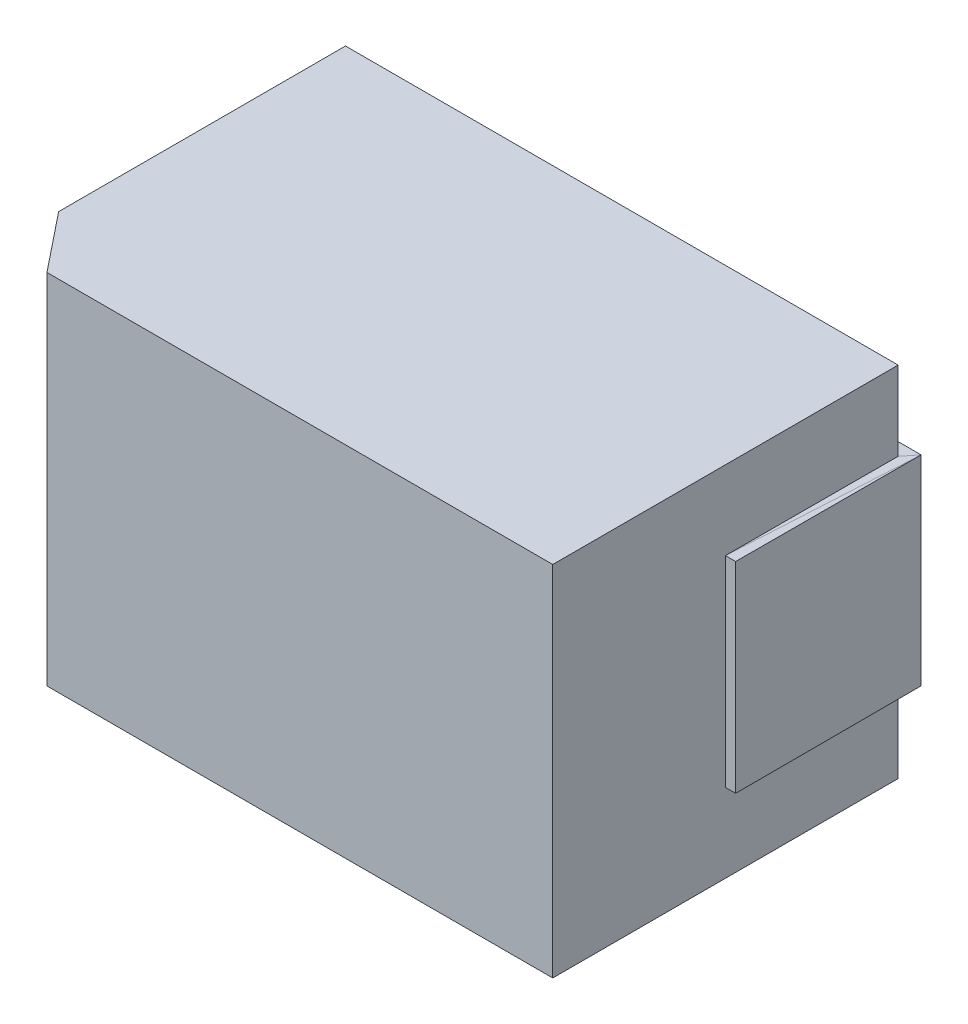
ISO-10303-21;
HEADER;
FILE_DESCRIPTION(('STEP AP214'),'2;1');
FILE_NAME('part.step','',(''),(''),'','','');
FILE_SCHEMA(('AUTOMOTIVE_DESIGN { 1 0 10303 214 1 1 1 1 }'));
ENDSEC;
DATA;
#1=APPLICATION_CONTEXT('core data for automotive mechanical design processes');
#2=APPLICATION_PROTOCOL_DEFINITION('international standard','automotive_design',2000,#1);
#3=PRODUCT_CONTEXT('',#1,'mechanical');
#4=PRODUCT('Part','Part','',(#3));
#5=PRODUCT_RELATED_PRODUCT_CATEGORY('part','',(#4));
#6=PRODUCT_DEFINITION_FORMATION('','',#4);
#7=PRODUCT_DEFINITION_CONTEXT('part definition',#1,'design');
#8=PRODUCT_DEFINITION('design','',#6,#7);
#9=PRODUCT_DEFINITION_SHAPE('','',#8);
#10=(LENGTH_UNIT() NAMED_UNIT(*) SI_UNIT(.MILLI.,.METRE.));
#11=(NAMED_UNIT(*) PLANE_ANGLE_UNIT() SI_UNIT($,.RADIAN.));
#12=(NAMED_UNIT(*) SI_UNIT($,.STERADIAN.) SOLID_ANGLE_UNIT());
#13=UNCERTAINTY_MEASURE_WITH_UNIT(LENGTH_MEASURE(1.E-05),#10,'distance_accuracy_value','');
#14=(GEOMETRIC_REPRESENTATION_CONTEXT(3) GLOBAL_UNCERTAINTY_ASSIGNED_CONTEXT((#13)) GLOBAL_UNIT_ASSIGNED_CONTEXT((#10,
#11,#12)) REPRESENTATION_CONTEXT('',''));
#15=CARTESIAN_POINT('',(0.,0.,0.));
#16=DIRECTION('',(0.,0.,1.));
#17=DIRECTION('',(1.,0.,0.));
#18=AXIS2_PLACEMENT_3D('',#15,#16,#17);
#19=CARTESIAN_POINT('',(-0.983756462733,-0.357373833656,0.664033412933));
#20=DIRECTION('',(0.,0.999998280454692,0.00185447773204043));
#21=DIRECTION('',(0.,-0.00185447773204043,0.999998280454692));
#22=AXIS2_PLACEMENT_3D('',#19,#20,#21);
#23=PLANE('',#22);
#24=DIRECTION('',(0.,0.00185447773165361,-0.999998280454693));
#25=VECTOR('',#24,1.);
#26=CARTESIAN_POINT('',(-1.019999980927,-0.357373833656,0.664033412933));
#27=LINE('',#26,#25);
#28=CARTESIAN_POINT('',(-1.019999980927,-0.357373833656,0.664033412933));
#29=VERTEX_POINT('',#28);
#30=CARTESIAN_POINT('',(-1.01999998092701,-0.356149593989057,0.00388120890905479));
#31=VERTEX_POINT('',#30);
#32=EDGE_CURVE('E144',#29,#31,#27,.T.);
#33=ORIENTED_EDGE('',*,*,#32,.T.);
#34=DIRECTION('',(-0.0548191105613321,0.00185168915759151,-0.998494585045171));
#35=VECTOR('',#34,1.);
#36=CARTESIAN_POINT('',(-0.983756462732999,-0.357373833656483,0.664033412932999));
#37=LINE('',#36,#35);
#38=CARTESIAN_POINT('',(-0.983756462732998,-0.357373833656128,0.664033412933001));
#39=VERTEX_POINT('',#38);
#40=EDGE_CURVE('E202',#39,#31,#37,.T.);
#41=ORIENTED_EDGE('',*,*,#40,.F.);
#42=DIRECTION('',(-1.,0.,0.));
#43=VECTOR('',#42,1.);
#44=CARTESIAN_POINT('',(-0.983756462733,-0.357373833656,0.664033412933));
#45=LINE('',#44,#43);
#46=EDGE_CURVE('E161',#39,#29,#45,.T.);
#47=ORIENTED_EDGE('',*,*,#46,.T.);
#48=EDGE_LOOP('',(#33,#41,#47));
#49=FACE_BOUND('',#48,.T.);
#50=ADVANCED_FACE('F17',(#49),#23,.F.);
#51=CARTESIAN_POINT('',(-1.019999980927,-0.356149593989,0.003881208909055));
#52=DIRECTION('',(1.,0.,0.));
#53=DIRECTION('',(0.,0.,-1.));
#54=AXIS2_PLACEMENT_3D('',#51,#52,#53);
#55=PLANE('',#54);
#56=DIRECTION('',(0.,1.,0.));
#57=VECTOR('',#56,1.);
#58=CARTESIAN_POINT('',(-1.019999980927,-0.357373833656,0.664033412933));
#59=LINE('',#58,#57);
#60=CARTESIAN_POINT('',(-1.01999875072126,0.357368821456571,0.664021502670164));
#61=VERTEX_POINT('',#60);
#62=EDGE_CURVE('E154',#29,#61,#59,.T.);
#63=ORIENTED_EDGE('',*,*,#62,.T.);
#64=DIRECTION('',(4.25847480385417E-06,0.00184573999130559,0.999998296611424));
#65=VECTOR('',#64,1.);
#66=CARTESIAN_POINT('',(-1.01999858770256,0.356754250472153,0.331045776259));
#67=LINE('',#66,#65);
#68=CARTESIAN_POINT('',(-1.019999980927,0.356150388717942,0.003881208909055));
#69=VERTEX_POINT('',#68);
#70=EDGE_CURVE('E133',#69,#61,#67,.T.);
#71=ORIENTED_EDGE('',*,*,#70,.F.);
#72=DIRECTION('',(0.,1.,0.));
#73=VECTOR('',#72,1.);
#74=CARTESIAN_POINT('',(-1.019999980927,-0.356149593989,0.003881208909055));
#75=LINE('',#74,#73);
#76=EDGE_CURVE('E143',#69,#31,#75,.F.);
#77=ORIENTED_EDGE('',*,*,#76,.T.);
#78=ORIENTED_EDGE('',*,*,#32,.F.);
#79=EDGE_LOOP('',(#63,#71,#77,#78));
#80=FACE_BOUND('',#79,.T.);
#81=ADVANCED_FACE('F157',(#80),#55,.F.);
#82=CARTESIAN_POINT('',(-1.010845503879,0.356733132559,0.331045776259));
#83=DIRECTION('',(0.00230718098753468,0.999995635061294,-0.00184574490385654));
#84=DIRECTION('',(-0.999997338445336,0.00230718491756711,0.));
#85=AXIS2_PLACEMENT_3D('',#82,#83,#84);
#86=PLANE('',#85);
#87=ORIENTED_EDGE('',*,*,#70,.T.);
#88=DIRECTION('',(0.0588448745080898,-0.00197831727719222,-0.998265178699967));
#89=VECTOR('',#88,1.);
#90=CARTESIAN_POINT('',(-1.019999980927,0.357368866602927,0.664033412933));
#91=LINE('',#90,#89);
#92=CARTESIAN_POINT('',(-0.983756462733,0.356150388718,0.0491856038570481));
#93=VERTEX_POINT('',#92);
#94=EDGE_CURVE('E136',#61,#93,#91,.T.);
#95=ORIENTED_EDGE('',*,*,#94,.T.);
#96=DIRECTION('',(-0.624695071050227,0.,-0.780868790646387));
#97=VECTOR('',#96,1.);
#98=CARTESIAN_POINT('',(-0.983756462733,0.356150388718,0.04918560385704));
#99=LINE('',#98,#97);
#100=EDGE_CURVE('E138',#93,#69,#99,.T.);
#101=ORIENTED_EDGE('',*,*,#100,.T.);
#102=EDGE_LOOP('',(#87,#95,#101));
#103=FACE_BOUND('',#102,.T.);
#104=ADVANCED_FACE('F135',(#103),#86,.T.);
#105=CARTESIAN_POINT('',(-1.019999980927,-0.356149593989,0.003881208909055));
#106=DIRECTION('',(0.,0.,1.));
#107=DIRECTION('',(1.,0.,0.));
#108=AXIS2_PLACEMENT_3D('',#105,#106,#107);
#109=PLANE('',#108);
#110=DIRECTION('',(0.,1.,0.));
#111=VECTOR('',#110,1.);
#112=CARTESIAN_POINT('',(-0.327918827534,-0.356149593989,0.003881208909055));
#113=LINE('',#112,#111);
#114=CARTESIAN_POINT('',(-0.327918827533999,0.356150388718,0.00388120890905494));
#115=VERTEX_POINT('',#114);
#116=CARTESIAN_POINT('',(-0.327918827534,-0.356149593989,0.003881208909055));
#117=VERTEX_POINT('',#116);
#118=EDGE_CURVE('E231',#115,#117,#113,.F.);
#119=ORIENTED_EDGE('',*,*,#118,.T.);
#120=DIRECTION('',(1.,0.,0.));
#121=VECTOR('',#120,1.);
#122=CARTESIAN_POINT('',(-0.327918827534,-0.356149593989,0.003881208909055));
#123=LINE('',#122,#121);
#124=EDGE_CURVE('E205',#117,#31,#123,.F.);
#125=ORIENTED_EDGE('',*,*,#124,.T.);
#126=ORIENTED_EDGE('',*,*,#76,.F.);
#127=DIRECTION('',(1.,0.,0.));
#128=VECTOR('',#127,1.);
#129=CARTESIAN_POINT('',(-0.983756462733,0.356150388718,0.003881208909055));
#130=LINE('',#129,#128);
#131=EDGE_CURVE('E179',#69,#115,#130,.T.);
#132=ORIENTED_EDGE('',*,*,#131,.T.);
#133=EDGE_LOOP('',(#119,#125,#126,#132));
#134=FACE_BOUND('',#133,.T.);
#135=ADVANCED_FACE('F411',(#134),#109,.F.);
#136=CARTESIAN_POINT('',(-0.983756462733,-0.356149593989,0.04918560385704));
#137=DIRECTION('',(0.,1.,0.));
#138=DIRECTION('',(0.,0.,1.));
#139=AXIS2_PLACEMENT_3D('',#136,#137,#138);
#140=PLANE('',#139);
#141=DIRECTION('',(0.624695071050227,0.,0.780868790646387));
#142=VECTOR('',#141,1.);
#143=CARTESIAN_POINT('',(-1.019999980927,-0.356149593989229,0.00388120890905446));
#144=LINE('',#143,#142);
#145=CARTESIAN_POINT('',(-0.983756462733,-0.356149593989028,0.0491856038570399));
#146=VERTEX_POINT('',#145);
#147=EDGE_CURVE('E199',#31,#146,#144,.T.);
#148=ORIENTED_EDGE('',*,*,#147,.F.);
#149=ORIENTED_EDGE('',*,*,#124,.F.);
#150=DIRECTION('',(0.,0.,1.));
#151=VECTOR('',#150,1.);
#152=CARTESIAN_POINT('',(-0.327918827534,-0.356149593989,0.04918560385704));
#153=LINE('',#152,#151);
#154=CARTESIAN_POINT('',(-0.327918798711544,-0.356149593989,0.0491856057437897));
#155=VERTEX_POINT('',#154);
#156=EDGE_CURVE('E228',#117,#155,#153,.T.);
#157=ORIENTED_EDGE('',*,*,#156,.T.);
#158=DIRECTION('',(1.,0.,0.));
#159=VECTOR('',#158,1.);
#160=CARTESIAN_POINT('',(-0.983756462733,-0.356149593989,0.04918560385704));
#161=LINE('',#160,#159);
#162=EDGE_CURVE('E221',#155,#146,#161,.F.);
#163=ORIENTED_EDGE('',*,*,#162,.T.);
#164=EDGE_LOOP('',(#148,#149,#157,#163));
#165=FACE_BOUND('',#164,.T.);
#166=ADVANCED_FACE('F407',(#165),#140,.F.);
#167=CARTESIAN_POINT('',(-0.993525879162,-0.356735091976,0.331027493675));
#168=DIRECTION('',(0.00248889512790028,-0.999994920415709,-0.00199111622511442));
#169=DIRECTION('',(0.999996902683445,0.00248890006158185,0.));
#170=AXIS2_PLACEMENT_3D('',#167,#168,#169);
#171=PLANE('',#170);
#172=ORIENTED_EDGE('',*,*,#40,.T.);
#173=ORIENTED_EDGE('',*,*,#147,.T.);
#174=DIRECTION('',(0.,-0.00199112239181037,0.999998017713846));
#175=VECTOR('',#174,1.);
#176=CARTESIAN_POINT('',(-0.983756462733,-0.356149593989,0.04918560385704));
#177=LINE('',#176,#175);
#178=EDGE_CURVE('E166',#146,#39,#177,.T.);
#179=ORIENTED_EDGE('',*,*,#178,.T.);
#180=EDGE_LOOP('',(#172,#173,#179));
#181=FACE_BOUND('',#180,.T.);
#182=ADVANCED_FACE('F627',(#181),#171,.T.);
#183=CARTESIAN_POINT('',(-0.983756462733,0.356150388718,0.04918560385704));
#184=DIRECTION('',(0.,-0.999998036328812,0.00198175137692763));
#185=DIRECTION('',(0.,-0.00198175137692763,-0.999998036328812));
#186=AXIS2_PLACEMENT_3D('',#183,#184,#185);
#187=PLANE('',#186);
#188=DIRECTION('',(-1.,0.,0.));
#189=VECTOR('',#188,1.);
#190=CARTESIAN_POINT('',(-0.983756462733,0.357368866603,0.664033412933));
#191=LINE('',#190,#189);
#192=CARTESIAN_POINT('',(-0.983756462733,0.357368866602964,0.664033412933));
#193=VERTEX_POINT('',#192);
#194=EDGE_CURVE('E150',#61,#193,#191,.F.);
#195=ORIENTED_EDGE('',*,*,#194,.T.);
#196=DIRECTION('',(0.,-0.00198175137704623,-0.999998036328812));
#197=VECTOR('',#196,1.);
#198=CARTESIAN_POINT('',(-0.983756462733,0.357368866603,0.664033412933));
#199=LINE('',#198,#197);
#200=EDGE_CURVE('E152',#193,#93,#199,.T.);
#201=ORIENTED_EDGE('',*,*,#200,.T.);
#202=ORIENTED_EDGE('',*,*,#94,.F.);
#203=EDGE_LOOP('',(#195,#201,#202));
#204=FACE_BOUND('',#203,.T.);
#205=ADVANCED_FACE('F148',(#204),#187,.F.);
#206=CARTESIAN_POINT('',(0.327918827534,0.356149593989,0.04918560385704));
#207=DIRECTION('',(1.,0.,0.));
#208=DIRECTION('',(0.,0.,-1.));
#209=AXIS2_PLACEMENT_3D('',#206,#207,#208);
#210=PLANE('',#209);
#211=DIRECTION('',(0.,1.,0.));
#212=VECTOR('',#211,1.);
#213=CARTESIAN_POINT('',(0.327918827534,0.356149593989,0.003881208909055));
#214=LINE('',#213,#212);
#215=CARTESIAN_POINT('',(0.327918827534,0.356149593989,0.003881208909055));
#216=VERTEX_POINT('',#215);
#217=CARTESIAN_POINT('',(0.327918827533999,-0.356150388718,0.00388120890905497));
#218=VERTEX_POINT('',#217);
#219=EDGE_CURVE('E225',#216,#218,#214,.F.);
#220=ORIENTED_EDGE('',*,*,#219,.T.);
#221=DIRECTION('',(0.,0.,1.));
#222=VECTOR('',#221,1.);
#223=CARTESIAN_POINT('',(0.327918827534,-0.356150388718,0.04918560385704));
#224=LINE('',#223,#222);
#225=CARTESIAN_POINT('',(0.327918827534,-0.35615019003575,0.04918560385704));
#226=VERTEX_POINT('',#225);
#227=EDGE_CURVE('E224',#218,#226,#224,.T.);
#228=ORIENTED_EDGE('',*,*,#227,.T.);
#229=DIRECTION('',(0.,1.,0.));
#230=VECTOR('',#229,1.);
#231=CARTESIAN_POINT('',(0.327918827534,0.356149593989,0.04918560385704));
#232=LINE('',#231,#230);
#233=CARTESIAN_POINT('',(0.327918820297511,0.356149597093397,0.0491856038570396));
#234=VERTEX_POINT('',#233);
#235=EDGE_CURVE('E250',#226,#234,#232,.T.);
#236=ORIENTED_EDGE('',*,*,#235,.T.);
#237=DIRECTION('',(0.,0.,-1.));
#238=VECTOR('',#237,1.);
#239=CARTESIAN_POINT('',(0.327918827534,0.356149593989,0.04918560385704));
#240=LINE('',#239,#238);
#241=EDGE_CURVE('E253',#234,#216,#240,.T.);
#242=ORIENTED_EDGE('',*,*,#241,.T.);
#243=EDGE_LOOP('',(#220,#228,#236,#242));
#244=FACE_BOUND('',#243,.T.);
#245=ADVANCED_FACE('F271',(#244),#210,.F.);
#246=CARTESIAN_POINT('',(1.019999980927,0.356149593989,0.003881208909055));
#247=DIRECTION('',(0.,0.,1.));
#248=DIRECTION('',(1.,0.,0.));
#249=AXIS2_PLACEMENT_3D('',#246,#247,#248);
#250=PLANE('',#249);
#251=DIRECTION('',(1.,0.,0.));
#252=VECTOR('',#251,1.);
#253=CARTESIAN_POINT('',(0.983756462733,-0.356150388718,0.003881208909055));
#254=LINE('',#253,#252);
#255=CARTESIAN_POINT('',(1.02000034249176,-0.356150388718,0.00388075695312987));
#256=VERTEX_POINT('',#255);
#257=EDGE_CURVE('E280',#256,#218,#254,.F.);
#258=ORIENTED_EDGE('',*,*,#257,.T.);
#259=ORIENTED_EDGE('',*,*,#219,.F.);
#260=DIRECTION('',(1.,0.,0.));
#261=VECTOR('',#260,1.);
#262=CARTESIAN_POINT('',(0.327918827534,0.356149593989,0.003881208909055));
#263=LINE('',#262,#261);
#264=CARTESIAN_POINT('',(1.01999998092701,0.356149593989004,0.00388120890905483));
#265=VERTEX_POINT('',#264);
#266=EDGE_CURVE('E259',#216,#265,#263,.T.);
#267=ORIENTED_EDGE('',*,*,#266,.T.);
#268=DIRECTION('',(0.,1.,0.));
#269=VECTOR('',#268,1.);
#270=CARTESIAN_POINT('',(1.019999980927,0.356149593989,0.003881208909055));
#271=LINE('',#270,#269);
#272=EDGE_CURVE('E284',#265,#256,#271,.F.);
#273=ORIENTED_EDGE('',*,*,#272,.T.);
#274=EDGE_LOOP('',(#258,#259,#267,#273));
#275=FACE_BOUND('',#274,.T.);
#276=ADVANCED_FACE('F283',(#275),#250,.F.);
#277=CARTESIAN_POINT('',(-0.983756462733,-0.357373833656,0.664033412933));
#278=DIRECTION('',(0.,0.,-1.));
#279=DIRECTION('',(-1.,0.,0.));
#280=AXIS2_PLACEMENT_3D('',#277,#278,#279);
#281=PLANE('',#280);
#282=ORIENTED_EDGE('',*,*,#194,.F.);
#283=ORIENTED_EDGE('',*,*,#62,.F.);
#284=ORIENTED_EDGE('',*,*,#46,.F.);
#285=DIRECTION('',(0.,1.,0.));
#286=VECTOR('',#285,1.);
#287=CARTESIAN_POINT('',(-0.983756462733,-0.357373833656,0.664033412933));
#288=LINE('',#287,#286);
#289=EDGE_CURVE('E165',#39,#193,#288,.T.);
#290=ORIENTED_EDGE('',*,*,#289,.T.);
#291=EDGE_LOOP('',(#282,#283,#284,#290));
#292=FACE_BOUND('',#291,.T.);
#293=ADVANCED_FACE('F163',(#292),#281,.F.);
#294=CARTESIAN_POINT('',(-0.983756462733,0.356150388718,0.04918560385704));
#295=DIRECTION('',(0.,-1.,0.));
#296=DIRECTION('',(0.,0.,-1.));
#297=AXIS2_PLACEMENT_3D('',#294,#295,#296);
#298=PLANE('',#297);
#299=DIRECTION('',(0.,0.,1.));
#300=VECTOR('',#299,1.);
#301=CARTESIAN_POINT('',(-0.327918827534,0.356150388718,0.04918560385704));
#302=LINE('',#301,#300);
#303=CARTESIAN_POINT('',(-0.327918827534,0.356150339047437,0.04918560385704));
#304=VERTEX_POINT('',#303);
#305=EDGE_CURVE('E168',#304,#115,#302,.F.);
#306=ORIENTED_EDGE('',*,*,#305,.T.);
#307=ORIENTED_EDGE('',*,*,#131,.F.);
#308=ORIENTED_EDGE('',*,*,#100,.F.);
#309=DIRECTION('',(1.,0.,0.));
#310=VECTOR('',#309,1.);
#311=CARTESIAN_POINT('',(-0.327918827534,0.356150388718,0.04918560385704));
#312=LINE('',#311,#310);
#313=EDGE_CURVE('E187',#93,#304,#312,.T.);
#314=ORIENTED_EDGE('',*,*,#313,.T.);
#315=EDGE_LOOP('',(#306,#307,#308,#314));
#316=FACE_BOUND('',#315,.T.);
#317=ADVANCED_FACE('F412',(#316),#298,.F.);
#318=CARTESIAN_POINT('',(-0.327918827534,0.356150388718,0.04918560385704));
#319=DIRECTION('',(-1.,0.,0.));
#320=DIRECTION('',(0.,0.,1.));
#321=AXIS2_PLACEMENT_3D('',#318,#319,#320);
#322=PLANE('',#321);
#323=DIRECTION('',(0.,1.,0.));
#324=VECTOR('',#323,1.);
#325=CARTESIAN_POINT('',(-0.327918827534,0.356149593989,0.04918560385704));
#326=LINE('',#325,#324);
#327=EDGE_CURVE('E192',#304,#155,#326,.F.);
#328=ORIENTED_EDGE('',*,*,#327,.T.);
#329=ORIENTED_EDGE('',*,*,#156,.F.);
#330=ORIENTED_EDGE('',*,*,#118,.F.);
#331=ORIENTED_EDGE('',*,*,#305,.F.);
#332=EDGE_LOOP('',(#328,#329,#330,#331));
#333=FACE_BOUND('',#332,.T.);
#334=ADVANCED_FACE('F409',(#333),#322,.F.);
#335=CARTESIAN_POINT('',(0.983756462733,-0.356150388718,0.04918560385704));
#336=DIRECTION('',(0.,1.,0.));
#337=DIRECTION('',(0.,0.,1.));
#338=AXIS2_PLACEMENT_3D('',#335,#336,#337);
#339=PLANE('',#338);
#340=ORIENTED_EDGE('',*,*,#257,.F.);
#341=DIRECTION('',(-0.624695071050227,0.,0.780868790646388));
#342=VECTOR('',#341,1.);
#343=CARTESIAN_POINT('',(1.019999980927,-0.356150388718001,0.00388120890905499));
#344=LINE('',#343,#342);
#345=CARTESIAN_POINT('',(0.983756462733,-0.356150388717997,0.04918560385704));
#346=VERTEX_POINT('',#345);
#347=EDGE_CURVE('E319',#256,#346,#344,.T.);
#348=ORIENTED_EDGE('',*,*,#347,.T.);
#349=DIRECTION('',(1.,0.,0.));
#350=VECTOR('',#349,1.);
#351=CARTESIAN_POINT('',(0.327918827534,-0.356150388718,0.04918560385704));
#352=LINE('',#351,#350);
#353=EDGE_CURVE('E282',#346,#226,#352,.F.);
#354=ORIENTED_EDGE('',*,*,#353,.T.);
#355=ORIENTED_EDGE('',*,*,#227,.F.);
#356=EDGE_LOOP('',(#340,#348,#354,#355));
#357=FACE_BOUND('',#356,.T.);
#358=ADVANCED_FACE('F278',(#357),#339,.F.);
#359=CARTESIAN_POINT('',(0.983756462733,0.356149593989,0.04918560385704));
#360=DIRECTION('',(0.,-1.,0.));
#361=DIRECTION('',(0.,0.,-1.));
#362=AXIS2_PLACEMENT_3D('',#359,#360,#361);
#363=PLANE('',#362);
#364=DIRECTION('',(-0.624695071050227,0.,0.780868790646388));
#365=VECTOR('',#364,1.);
#366=CARTESIAN_POINT('',(1.019999980927,0.356149593988792,0.00388120890905532));
#367=LINE('',#366,#365);
#368=CARTESIAN_POINT('',(0.983756462733,0.356149593988974,0.04918560385704));
#369=VERTEX_POINT('',#368);
#370=EDGE_CURVE('E294',#265,#369,#367,.T.);
#371=ORIENTED_EDGE('',*,*,#370,.F.);
#372=ORIENTED_EDGE('',*,*,#266,.F.);
#373=ORIENTED_EDGE('',*,*,#241,.F.);
#374=DIRECTION('',(1.,0.,0.));
#375=VECTOR('',#374,1.);
#376=CARTESIAN_POINT('',(0.983756462733,0.356149593989,0.04918560385704));
#377=LINE('',#376,#375);
#378=EDGE_CURVE('E297',#234,#369,#377,.T.);
#379=ORIENTED_EDGE('',*,*,#378,.T.);
#380=EDGE_LOOP('',(#371,#372,#373,#379));
#381=FACE_BOUND('',#380,.T.);
#382=ADVANCED_FACE('F296',(#381),#363,.F.);
#383=CARTESIAN_POINT('',(1.010690559846,0.356787113109,0.342769633344));
#384=DIRECTION('',(0.,-0.999998230535678,0.00188120320900539));
#385=DIRECTION('',(0.,-0.00188120320900539,-0.999998230535678));
#386=AXIS2_PLACEMENT_3D('',#383,#384,#385);
#387=PLANE('',#386);
#388=DIRECTION('',(0.,-0.00188120320884056,-0.999998230535678));
#389=VECTOR('',#388,1.);
#390=CARTESIAN_POINT('',(1.019999980927,0.357391476631,0.664033412933));
#391=LINE('',#390,#389);
#392=CARTESIAN_POINT('',(1.019999980927,0.35739147663125,0.664033412932999));
#393=VERTEX_POINT('',#392);
#394=EDGE_CURVE('E236',#393,#265,#391,.T.);
#395=ORIENTED_EDGE('',*,*,#394,.T.);
#396=DIRECTION('',(0.0548191078330343,-0.00187837444779313,-0.998494535351007));
#397=VECTOR('',#396,1.);
#398=CARTESIAN_POINT('',(0.983756462733,0.3573914766309,0.664033412933));
#399=LINE('',#398,#397);
#400=CARTESIAN_POINT('',(0.983756462733,0.357391476631228,0.664033412933));
#401=VERTEX_POINT('',#400);
#402=EDGE_CURVE('E302',#401,#265,#399,.T.);
#403=ORIENTED_EDGE('',*,*,#402,.F.);
#404=DIRECTION('',(-1.,0.,0.));
#405=VECTOR('',#404,1.);
#406=CARTESIAN_POINT('',(0.983756462733,0.357391476631,0.664033412933));
#407=LINE('',#406,#405);
#408=EDGE_CURVE('E301',#401,#393,#407,.F.);
#409=ORIENTED_EDGE('',*,*,#408,.T.);
#410=EDGE_LOOP('',(#395,#403,#409));
#411=FACE_BOUND('',#410,.T.);
#412=ADVANCED_FACE('F312',(#411),#387,.F.);
#413=CARTESIAN_POINT('',(1.019999980927,0.356149593989,0.003881208909055));
#414=DIRECTION('',(-1.,0.,0.));
#415=DIRECTION('',(0.,0.,1.));
#416=AXIS2_PLACEMENT_3D('',#413,#414,#415);
#417=PLANE('',#416);
#418=DIRECTION('',(0.,1.,0.));
#419=VECTOR('',#418,1.);
#420=CARTESIAN_POINT('',(1.019999980927,0.357391476631,0.664033412933));
#421=LINE('',#420,#419);
#422=CARTESIAN_POINT('',(1.019999980927,-0.357386350632003,0.664033412933));
#423=VERTEX_POINT('',#422);
#424=EDGE_CURVE('E356',#393,#423,#421,.F.);
#425=ORIENTED_EDGE('',*,*,#424,.T.);
#426=DIRECTION('',(-4.38156105531724E-06,-0.00187222427047824,0.999998247377006));
#427=VECTOR('',#426,1.);
#428=CARTESIAN_POINT('',(1.02000267492494,-0.356235215623754,0.04918560385704));
#429=LINE('',#428,#427);
#430=EDGE_CURVE('E316',#423,#256,#429,.F.);
#431=ORIENTED_EDGE('',*,*,#430,.T.);
#432=ORIENTED_EDGE('',*,*,#272,.F.);
#433=ORIENTED_EDGE('',*,*,#394,.F.);
#434=EDGE_LOOP('',(#425,#431,#432,#433));
#435=FACE_BOUND('',#434,.T.);
#436=ADVANCED_FACE('F448',(#435),#417,.F.);
#437=CARTESIAN_POINT('',(0.983756462733,-0.356150388718,0.04918560385704));
#438=DIRECTION('',(0.00234028660260845,0.999995508897765,0.00187222939754856));
#439=DIRECTION('',(-0.99999726151596,0.00234029070425575,0.));
#440=AXIS2_PLACEMENT_3D('',#437,#438,#439);
#441=PLANE('',#440);
#442=ORIENTED_EDGE('',*,*,#430,.F.);
#443=DIRECTION('',(0.058844871179739,-0.00200670418436593,0.998265122236651));
#444=VECTOR('',#443,1.);
#445=CARTESIAN_POINT('',(0.983756462733,-0.356150388717569,0.0491856038570409));
#446=LINE('',#445,#444);
#447=EDGE_CURVE('E347',#346,#423,#446,.T.);
#448=ORIENTED_EDGE('',*,*,#447,.F.);
#449=ORIENTED_EDGE('',*,*,#347,.F.);
#450=EDGE_LOOP('',(#442,#448,#449));
#451=FACE_BOUND('',#450,.T.);
#452=ADVANCED_FACE('F365',(#451),#441,.F.);
#453=CARTESIAN_POINT('',(-0.863015926909,-0.05981974336608,1.221378294819));
#454=DIRECTION('',(-0.780868838491225,0.,0.62469501124418));
#455=DIRECTION('',(0.62469501124418,0.,0.780868838491225));
#456=AXIS2_PLACEMENT_3D('',#453,#454,#455);
#457=PLANE('',#456);
#458=DIRECTION('',(0.,1.,0.));
#459=VECTOR('',#458,1.);
#460=CARTESIAN_POINT('',(-0.817013581594,-0.637500007947,1.278881231944));
#461=LINE('',#460,#459);
#462=CARTESIAN_POINT('',(-0.817013581594024,-0.637500007947,1.27888123194402));
#463=VERTEX_POINT('',#462);
#464=CARTESIAN_POINT('',(-0.817013581594054,0.637500007947005,1.27888123194404));
#465=VERTEX_POINT('',#464);
#466=EDGE_CURVE('E361',#463,#465,#461,.T.);
#467=ORIENTED_EDGE('',*,*,#466,.T.);
#468=DIRECTION('',(-0.62469501124418,0.,-0.780868838491225));
#469=VECTOR('',#468,1.);
#470=CARTESIAN_POINT('',(-0.983756462733,0.637500007947,1.070452610652));
#471=LINE('',#470,#469);
#472=CARTESIAN_POINT('',(-0.983756462733,0.637500007947,1.070452610652));
#473=VERTEX_POINT('',#472);
#474=EDGE_CURVE('E211',#473,#465,#471,.F.);
#475=ORIENTED_EDGE('',*,*,#474,.F.);
#476=DIRECTION('',(0.,1.,0.));
#477=VECTOR('',#476,1.);
#478=CARTESIAN_POINT('',(-0.983756462733,-0.637500007947,1.070452610652));
#479=LINE('',#478,#477);
#480=CARTESIAN_POINT('',(-0.983756462733002,-0.637500007946999,1.070452610652));
#481=VERTEX_POINT('',#480);
#482=EDGE_CURVE('E287',#481,#473,#479,.T.);
#483=ORIENTED_EDGE('',*,*,#482,.F.);
#484=DIRECTION('',(0.624695011244404,0.,0.780868838491045));
#485=VECTOR('',#484,1.);
#486=CARTESIAN_POINT('',(-0.983756462733,-0.637500007947,1.070452610652));
#487=LINE('',#486,#485);
#488=EDGE_CURVE('E339',#481,#463,#487,.T.);
#489=ORIENTED_EDGE('',*,*,#488,.T.);
#490=EDGE_LOOP('',(#467,#475,#483,#489));
#491=FACE_BOUND('',#490,.T.);
#492=ADVANCED_FACE('F338',(#491),#457,.T.);
#493=CARTESIAN_POINT('',(-0.983756462733,-0.637500007947,0.664033412933));
#494=DIRECTION('',(1.,0.,0.));
#495=DIRECTION('',(0.,0.,-1.));
#496=AXIS2_PLACEMENT_3D('',#493,#494,#495);
#497=PLANE('',#496);
#498=DIRECTION('',(0.,0.,1.));
#499=VECTOR('',#498,1.);
#500=CARTESIAN_POINT('',(-0.983756462733,-0.637500007947,0.664033412933));
#501=LINE('',#500,#499);
#502=CARTESIAN_POINT('',(-0.983756462733,-0.637500007947,0.04918560385704));
#503=VERTEX_POINT('',#502);
#504=EDGE_CURVE('E332',#503,#481,#501,.T.);
#505=ORIENTED_EDGE('',*,*,#504,.T.);
#506=ORIENTED_EDGE('',*,*,#482,.T.);
#507=DIRECTION('',(0.,0.,-1.));
#508=VECTOR('',#507,1.);
#509=CARTESIAN_POINT('',(-0.983756462733,0.637500007947,0.04918560385704));
#510=LINE('',#509,#508);
#511=CARTESIAN_POINT('',(-0.983756462733,0.637500007947,0.04918560385704));
#512=VERTEX_POINT('',#511);
#513=EDGE_CURVE('E329',#473,#512,#510,.T.);
#514=ORIENTED_EDGE('',*,*,#513,.T.);
#515=DIRECTION('',(0.,1.,0.));
#516=VECTOR('',#515,1.);
#517=CARTESIAN_POINT('',(-0.983756462733,0.637500007947,0.04918560385704));
#518=LINE('',#517,#516);
#519=EDGE_CURVE('E184',#93,#512,#518,.T.);
#520=ORIENTED_EDGE('',*,*,#519,.F.);
#521=ORIENTED_EDGE('',*,*,#200,.F.);
#522=ORIENTED_EDGE('',*,*,#289,.F.);
#523=ORIENTED_EDGE('',*,*,#178,.F.);
#524=DIRECTION('',(0.,1.,0.));
#525=VECTOR('',#524,1.);
#526=CARTESIAN_POINT('',(-0.983756462733,-0.637500007947,0.04918560385704));
#527=LINE('',#526,#525);
#528=EDGE_CURVE('E171',#503,#146,#527,.T.);
#529=ORIENTED_EDGE('',*,*,#528,.F.);
#530=EDGE_LOOP('',(#505,#506,#514,#520,#521,#522,#523,#529));
#531=FACE_BOUND('',#530,.T.);
#532=ADVANCED_FACE('F328',(#531),#497,.F.);
#533=CARTESIAN_POINT('',(0.993525879109,0.356743529807,0.331027494426));
#534=DIRECTION('',(-0.00252476315238783,0.999994772954327,-0.00201981064647366));
#535=DIRECTION('',(-0.99999681276743,-0.00252476830245971,0.));
#536=AXIS2_PLACEMENT_3D('',#533,#534,#535);
#537=PLANE('',#536);
#538=ORIENTED_EDGE('',*,*,#402,.T.);
#539=ORIENTED_EDGE('',*,*,#370,.T.);
#540=DIRECTION('',(0.,0.00201981708389548,0.999997960167393));
#541=VECTOR('',#540,1.);
#542=CARTESIAN_POINT('',(0.983756462733,0.356149593989,0.04918560385704));
#543=LINE('',#542,#541);
#544=EDGE_CURVE('E307',#369,#401,#543,.T.);
#545=ORIENTED_EDGE('',*,*,#544,.T.);
#546=EDGE_LOOP('',(#538,#539,#545));
#547=FACE_BOUND('',#546,.T.);
#548=ADVANCED_FACE('F306',(#547),#537,.T.);
#549=CARTESIAN_POINT('',(0.993084166611,-0.356786047375,0.365403545846));
#550=DIRECTION('',(0.,-0.999997979570946,-0.00201018755965989));
#551=DIRECTION('',(0.,0.00201018755965989,-0.999997979570946));
#552=AXIS2_PLACEMENT_3D('',#549,#550,#551);
#553=PLANE('',#552);
#554=DIRECTION('',(-1.,0.,0.));
#555=VECTOR('',#554,1.);
#556=CARTESIAN_POINT('',(0.983756462733,-0.357386350632,0.664033412933));
#557=LINE('',#556,#555);
#558=CARTESIAN_POINT('',(0.983756462733,-0.357386350631816,0.664033412933));
#559=VERTEX_POINT('',#558);
#560=EDGE_CURVE('E371',#423,#559,#557,.T.);
#561=ORIENTED_EDGE('',*,*,#560,.T.);
#562=DIRECTION('',(0.,0.00201018755955922,-0.999997979570947));
#563=VECTOR('',#562,1.);
#564=CARTESIAN_POINT('',(0.983756462733,-0.357386350632,0.664033412933));
#565=LINE('',#564,#563);
#566=EDGE_CURVE('E368',#559,#346,#565,.T.);
#567=ORIENTED_EDGE('',*,*,#566,.T.);
#568=ORIENTED_EDGE('',*,*,#447,.T.);
#569=EDGE_LOOP('',(#561,#567,#568));
#570=FACE_BOUND('',#569,.T.);
#571=ADVANCED_FACE('F369',(#570),#553,.T.);
#572=CARTESIAN_POINT('',(0.327918827534,0.637500007947,0.04918560385704));
#573=DIRECTION('',(0.,0.,1.));
#574=DIRECTION('',(1.,0.,0.));
#575=AXIS2_PLACEMENT_3D('',#572,#573,#574);
#576=PLANE('',#575);
#577=DIRECTION('',(1.,0.,0.));
#578=VECTOR('',#577,1.);
#579=CARTESIAN_POINT('',(0.327918827534,0.637500007947,0.04918560385704));
#580=LINE('',#579,#578);
#581=CARTESIAN_POINT('',(0.983756462733,0.637500007947,0.04918560385704));
#582=VERTEX_POINT('',#581);
#583=EDGE_CURVE('E375',#512,#582,#580,.T.);
#584=ORIENTED_EDGE('',*,*,#583,.T.);
#585=DIRECTION('',(0.,1.,0.));
#586=VECTOR('',#585,1.);
#587=CARTESIAN_POINT('',(0.983756462733,0.637500007947,0.04918560385704));
#588=LINE('',#587,#586);
#589=EDGE_CURVE('E345',#582,#369,#588,.F.);
#590=ORIENTED_EDGE('',*,*,#589,.T.);
#591=ORIENTED_EDGE('',*,*,#378,.F.);
#592=ORIENTED_EDGE('',*,*,#235,.F.);
#593=ORIENTED_EDGE('',*,*,#353,.F.);
#594=DIRECTION('',(0.,1.,0.));
#595=VECTOR('',#594,1.);
#596=CARTESIAN_POINT('',(0.983756462733,-0.637500007947,0.04918560385704));
#597=LINE('',#596,#595);
#598=CARTESIAN_POINT('',(0.983756462733,-0.637500007947,0.04918560385704));
#599=VERTEX_POINT('',#598);
#600=EDGE_CURVE('E353',#346,#599,#597,.F.);
#601=ORIENTED_EDGE('',*,*,#600,.T.);
#602=DIRECTION('',(1.,0.,0.));
#603=VECTOR('',#602,1.);
#604=CARTESIAN_POINT('',(0.983756462733,-0.637500007947,0.04918560385704));
#605=LINE('',#604,#603);
#606=EDGE_CURVE('E343',#599,#503,#605,.F.);
#607=ORIENTED_EDGE('',*,*,#606,.T.);
#608=ORIENTED_EDGE('',*,*,#528,.T.);
#609=ORIENTED_EDGE('',*,*,#162,.F.);
#610=ORIENTED_EDGE('',*,*,#327,.F.);
#611=ORIENTED_EDGE('',*,*,#313,.F.);
#612=ORIENTED_EDGE('',*,*,#519,.T.);
#613=EDGE_LOOP('',(#584,#590,#591,#592,#593,#601,#607,#608,#609,#610,#611,#612));
#614=FACE_BOUND('',#613,.T.);
#615=ADVANCED_FACE('F385',(#614),#576,.F.);
#616=CARTESIAN_POINT('',(0.983756462733,-0.357386350632,0.664033412933));
#617=DIRECTION('',(0.,0.,-1.));
#618=DIRECTION('',(-1.,0.,0.));
#619=AXIS2_PLACEMENT_3D('',#616,#617,#618);
#620=PLANE('',#619);
#621=ORIENTED_EDGE('',*,*,#560,.F.);
#622=ORIENTED_EDGE('',*,*,#424,.F.);
#623=ORIENTED_EDGE('',*,*,#408,.F.);
#624=DIRECTION('',(0.,1.,0.));
#625=VECTOR('',#624,1.);
#626=CARTESIAN_POINT('',(0.983756462733,0.637500007947,0.664033412933));
#627=LINE('',#626,#625);
#628=EDGE_CURVE('E377',#401,#559,#627,.F.);
#629=ORIENTED_EDGE('',*,*,#628,.T.);
#630=EDGE_LOOP('',(#621,#622,#623,#629));
#631=FACE_BOUND('',#630,.T.);
#632=ADVANCED_FACE('F433',(#631),#620,.F.);
#633=CARTESIAN_POINT('',(0.983756462733,-0.637500007947,1.278881231944));
#634=DIRECTION('',(0.,1.,0.));
#635=DIRECTION('',(0.,0.,1.));
#636=AXIS2_PLACEMENT_3D('',#633,#634,#635);
#637=PLANE('',#636);
#638=DIRECTION('',(-1.,0.,0.));
#639=VECTOR('',#638,1.);
#640=CARTESIAN_POINT('',(0.983756462733,-0.637500007947,1.278881231944));
#641=LINE('',#640,#639);
#642=CARTESIAN_POINT('',(0.983756462733,-0.637500007947,1.278881231944));
#643=VERTEX_POINT('',#642);
#644=EDGE_CURVE('E341',#643,#463,#641,.T.);
#645=ORIENTED_EDGE('',*,*,#644,.T.);
#646=ORIENTED_EDGE('',*,*,#488,.F.);
#647=ORIENTED_EDGE('',*,*,#504,.F.);
#648=ORIENTED_EDGE('',*,*,#606,.F.);
#649=DIRECTION('',(0.,0.,1.));
#650=VECTOR('',#649,1.);
#651=CARTESIAN_POINT('',(0.983756462733,-0.637500007947,1.278881231944));
#652=LINE('',#651,#650);
#653=EDGE_CURVE('E35',#643,#599,#652,.F.);
#654=ORIENTED_EDGE('',*,*,#653,.F.);
#655=EDGE_LOOP('',(#645,#646,#647,#648,#654));
#656=FACE_BOUND('',#655,.T.);
#657=ADVANCED_FACE('F340',(#656),#637,.F.);
#658=CARTESIAN_POINT('',(0.983756462733,0.637500007947,1.278881231944));
#659=DIRECTION('',(-1.,0.,0.));
#660=DIRECTION('',(0.,0.,1.));
#661=AXIS2_PLACEMENT_3D('',#658,#659,#660);
#662=PLANE('',#661);
#663=DIRECTION('',(0.,1.,0.));
#664=VECTOR('',#663,1.);
#665=CARTESIAN_POINT('',(0.983756462733,0.637500007947,1.278881231944));
#666=LINE('',#665,#664);
#667=CARTESIAN_POINT('',(0.983756462733,0.637500007947,1.278881231944));
#668=VERTEX_POINT('',#667);
#669=EDGE_CURVE('E26',#668,#643,#666,.F.);
#670=ORIENTED_EDGE('',*,*,#669,.T.);
#671=ORIENTED_EDGE('',*,*,#653,.T.);
#672=ORIENTED_EDGE('',*,*,#600,.F.);
#673=ORIENTED_EDGE('',*,*,#566,.F.);
#674=ORIENTED_EDGE('',*,*,#628,.F.);
#675=ORIENTED_EDGE('',*,*,#544,.F.);
#676=ORIENTED_EDGE('',*,*,#589,.F.);
#677=DIRECTION('',(0.,0.,-1.));
#678=VECTOR('',#677,1.);
#679=CARTESIAN_POINT('',(0.983756462733,0.637500007947,1.278881231944));
#680=LINE('',#679,#678);
#681=EDGE_CURVE('E390',#582,#668,#680,.F.);
#682=ORIENTED_EDGE('',*,*,#681,.T.);
#683=EDGE_LOOP('',(#670,#671,#672,#673,#674,#675,#676,#682));
#684=FACE_BOUND('',#683,.T.);
#685=ADVANCED_FACE('F389',(#684),#662,.F.);
#686=CARTESIAN_POINT('',(0.983756462733,0.637500007947,1.278881231944));
#687=DIRECTION('',(0.,-1.,0.));
#688=DIRECTION('',(0.,0.,-1.));
#689=AXIS2_PLACEMENT_3D('',#686,#687,#688);
#690=PLANE('',#689);
#691=ORIENTED_EDGE('',*,*,#681,.F.);
#692=ORIENTED_EDGE('',*,*,#583,.F.);
#693=ORIENTED_EDGE('',*,*,#513,.F.);
#694=ORIENTED_EDGE('',*,*,#474,.T.);
#695=DIRECTION('',(-1.,0.,0.));
#696=VECTOR('',#695,1.);
#697=CARTESIAN_POINT('',(0.983756462733,0.637500007947,1.278881231944));
#698=LINE('',#697,#696);
#699=EDGE_CURVE('E11',#465,#668,#698,.F.);
#700=ORIENTED_EDGE('',*,*,#699,.T.);
#701=EDGE_LOOP('',(#691,#692,#693,#694,#700));
#702=FACE_BOUND('',#701,.T.);
#703=ADVANCED_FACE('F399',(#702),#690,.F.);
#704=CARTESIAN_POINT('',(0.983756462733,0.637500007947,1.278881231944));
#705=DIRECTION('',(0.,0.,-1.));
#706=DIRECTION('',(-1.,0.,0.));
#707=AXIS2_PLACEMENT_3D('',#704,#705,#706);
#708=PLANE('',#707);
#709=ORIENTED_EDGE('',*,*,#699,.F.);
#710=ORIENTED_EDGE('',*,*,#466,.F.);
#711=ORIENTED_EDGE('',*,*,#644,.F.);
#712=ORIENTED_EDGE('',*,*,#669,.F.);
#713=EDGE_LOOP('',(#709,#710,#711,#712));
#714=FACE_BOUND('',#713,.T.);
#715=ADVANCED_FACE('F397',(#714),#708,.F.);
#716=CLOSED_SHELL('',(#50,#81,#104,#135,#166,#182,#205,#245,#276,#293,#317,#334,#358,#382,#412,
#436,#452,#492,#532,#548,#571,#615,#632,#657,#685,#703,#715));
#717=MANIFOLD_SOLID_BREP('B1',#716);
#718=ADVANCED_BREP_SHAPE_REPRESENTATION('',(#18,#717),#14);
#719=SHAPE_DEFINITION_REPRESENTATION(#9,#718);
ENDSEC;
END-ISO-10303-21;
